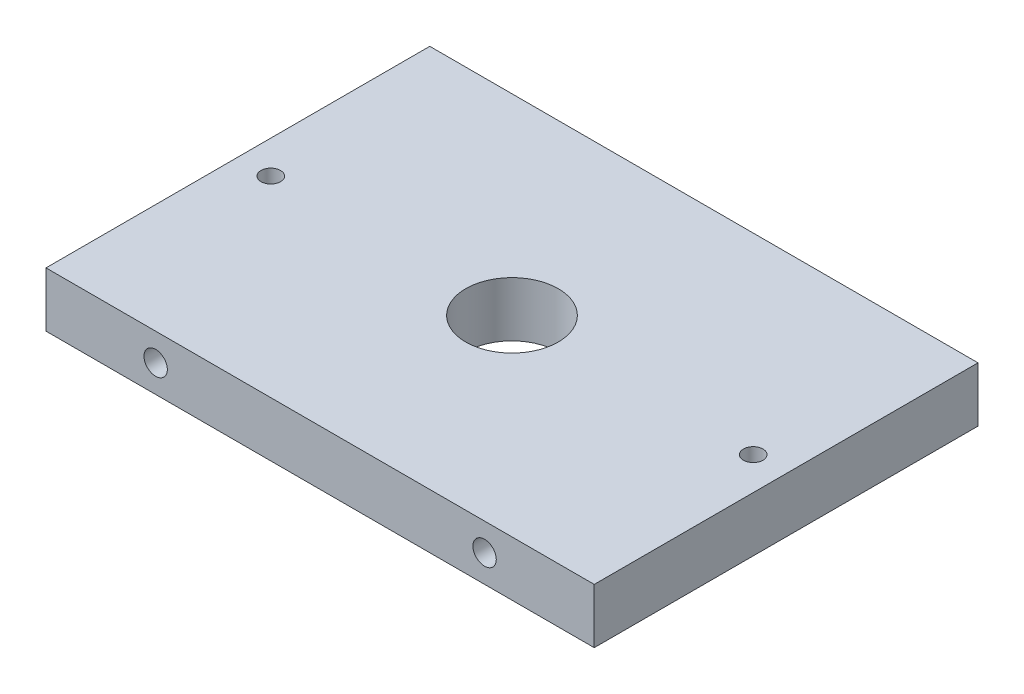
ISO-10303-21;
HEADER;
FILE_DESCRIPTION(('STEP AP214'),'2;1');
FILE_NAME('part.step','',(''),(''),'','','');
FILE_SCHEMA(('AUTOMOTIVE_DESIGN { 1 0 10303 214 1 1 1 1 }'));
ENDSEC;
DATA;
#1=APPLICATION_CONTEXT('core data for automotive mechanical design processes');
#2=APPLICATION_PROTOCOL_DEFINITION('international standard','automotive_design',2000,#1);
#3=PRODUCT_CONTEXT('',#1,'mechanical');
#4=PRODUCT('Part','Part','',(#3));
#5=PRODUCT_RELATED_PRODUCT_CATEGORY('part','',(#4));
#6=PRODUCT_DEFINITION_FORMATION('','',#4);
#7=PRODUCT_DEFINITION_CONTEXT('part definition',#1,'design');
#8=PRODUCT_DEFINITION('design','',#6,#7);
#9=PRODUCT_DEFINITION_SHAPE('','',#8);
#10=(LENGTH_UNIT() NAMED_UNIT(*) SI_UNIT(.MILLI.,.METRE.));
#11=(NAMED_UNIT(*) PLANE_ANGLE_UNIT() SI_UNIT($,.RADIAN.));
#12=(NAMED_UNIT(*) SI_UNIT($,.STERADIAN.) SOLID_ANGLE_UNIT());
#13=UNCERTAINTY_MEASURE_WITH_UNIT(LENGTH_MEASURE(1.E-05),#10,'distance_accuracy_value','');
#14=(GEOMETRIC_REPRESENTATION_CONTEXT(3) GLOBAL_UNCERTAINTY_ASSIGNED_CONTEXT((#13)) GLOBAL_UNIT_ASSIGNED_CONTEXT((#10,
#11,#12)) REPRESENTATION_CONTEXT('',''));
#15=CARTESIAN_POINT('',(0.,0.,0.));
#16=DIRECTION('',(0.,0.,1.));
#17=DIRECTION('',(1.,0.,0.));
#18=AXIS2_PLACEMENT_3D('',#15,#16,#17);
#19=CARTESIAN_POINT('',(-26.9974057296198,6.35,-3.26084320228637));
#20=DIRECTION('',(1.,0.,0.));
#21=DIRECTION('',(0.,0.,-1.));
#22=AXIS2_PLACEMENT_3D('',#19,#20,#21);
#23=PLANE('',#22);
#24=DIRECTION('',(0.,0.,1.));
#25=VECTOR('',#24,1.);
#26=CARTESIAN_POINT('',(-26.9974057296198,0.,-3.26084320228637));
#27=LINE('',#26,#25);
#28=CARTESIAN_POINT('',(-26.9974057296198,0.,-3.26084320228637));
#29=VERTEX_POINT('',#28);
#30=CARTESIAN_POINT('',(-26.9974057296198,0.,41.1891567977136));
#31=VERTEX_POINT('',#30);
#32=EDGE_CURVE('E138',#29,#31,#27,.T.);
#33=ORIENTED_EDGE('',*,*,#32,.T.);
#34=DIRECTION('',(0.,-1.,0.));
#35=VECTOR('',#34,1.);
#36=CARTESIAN_POINT('',(-26.9974057296198,6.35,41.1891567977136));
#37=LINE('',#36,#35);
#38=CARTESIAN_POINT('',(-26.9974057296198,6.35,41.1891567977136));
#39=VERTEX_POINT('',#38);
#40=EDGE_CURVE('E11',#39,#31,#37,.T.);
#41=ORIENTED_EDGE('',*,*,#40,.F.);
#42=DIRECTION('',(0.,0.,1.));
#43=VECTOR('',#42,1.);
#44=CARTESIAN_POINT('',(-26.9974057296198,6.35,-3.26084320228637));
#45=LINE('',#44,#43);
#46=CARTESIAN_POINT('',(-26.9974057296198,6.35,-3.26084320228637));
#47=VERTEX_POINT('',#46);
#48=EDGE_CURVE('E139',#47,#39,#45,.T.);
#49=ORIENTED_EDGE('',*,*,#48,.F.);
#50=DIRECTION('',(0.,-1.,0.));
#51=VECTOR('',#50,1.);
#52=CARTESIAN_POINT('',(-26.9974057296198,6.35,-3.26084320228637));
#53=LINE('',#52,#51);
#54=EDGE_CURVE('E145',#47,#29,#53,.T.);
#55=ORIENTED_EDGE('',*,*,#54,.T.);
#56=EDGE_LOOP('',(#33,#41,#49,#55));
#57=FACE_BOUND('',#56,.T.);
#58=ADVANCED_FACE('F31',(#57),#23,.F.);
#59=CARTESIAN_POINT('',(-26.9974057296198,6.35,41.1891567977136));
#60=DIRECTION('',(0.,0.,-1.));
#61=DIRECTION('',(-1.,0.,0.));
#62=AXIS2_PLACEMENT_3D('',#59,#60,#61);
#63=PLANE('',#62);
#64=CARTESIAN_POINT('',(23.8025942703802,3.175,41.1891567977136));
#65=DIRECTION('',(0.,0.,1.));
#66=DIRECTION('',(1.,0.,0.));
#67=AXIS2_PLACEMENT_3D('',#64,#65,#66);
#68=CIRCLE('',#67,1.35255);
#69=CARTESIAN_POINT('',(25.1551442703802,3.175,41.1891567977136));
#70=VERTEX_POINT('',#69);
#71=EDGE_CURVE('E114',#70,#70,#68,.T.);
#72=ORIENTED_EDGE('',*,*,#71,.F.);
#73=EDGE_LOOP('',(#72));
#74=FACE_BOUND('',#73,.T.);
#75=CARTESIAN_POINT('',(-14.2974057296198,3.175,41.1891567977136));
#76=DIRECTION('',(0.,0.,1.));
#77=DIRECTION('',(1.,0.,0.));
#78=AXIS2_PLACEMENT_3D('',#75,#76,#77);
#79=CIRCLE('',#78,1.35255);
#80=CARTESIAN_POINT('',(-12.9448557296198,3.175,41.1891567977136));
#81=VERTEX_POINT('',#80);
#82=EDGE_CURVE('E120',#81,#81,#79,.T.);
#83=ORIENTED_EDGE('',*,*,#82,.F.);
#84=EDGE_LOOP('',(#83));
#85=FACE_BOUND('',#84,.T.);
#86=DIRECTION('',(1.,0.,0.));
#87=VECTOR('',#86,1.);
#88=CARTESIAN_POINT('',(-26.9974057296198,0.,41.1891567977136));
#89=LINE('',#88,#87);
#90=CARTESIAN_POINT('',(36.5025942703802,0.,41.1891567977136));
#91=VERTEX_POINT('',#90);
#92=EDGE_CURVE('E148',#31,#91,#89,.T.);
#93=ORIENTED_EDGE('',*,*,#92,.T.);
#94=DIRECTION('',(0.,-1.,0.));
#95=VECTOR('',#94,1.);
#96=CARTESIAN_POINT('',(36.5025942703802,6.35,41.1891567977136));
#97=LINE('',#96,#95);
#98=CARTESIAN_POINT('',(36.5025942703802,6.35,41.1891567977136));
#99=VERTEX_POINT('',#98);
#100=EDGE_CURVE('E39',#99,#91,#97,.T.);
#101=ORIENTED_EDGE('',*,*,#100,.F.);
#102=DIRECTION('',(1.,0.,0.));
#103=VECTOR('',#102,1.);
#104=CARTESIAN_POINT('',(-26.9974057296198,6.35,41.1891567977136));
#105=LINE('',#104,#103);
#106=EDGE_CURVE('E78',#39,#99,#105,.T.);
#107=ORIENTED_EDGE('',*,*,#106,.F.);
#108=ORIENTED_EDGE('',*,*,#40,.T.);
#109=EDGE_LOOP('',(#93,#101,#107,#108));
#110=FACE_BOUND('',#109,.T.);
#111=ADVANCED_FACE('F173',(#74,#85,#110),#63,.F.);
#112=CARTESIAN_POINT('',(36.5025942703802,6.35,-3.26084320228637));
#113=DIRECTION('',(-1.,0.,0.));
#114=DIRECTION('',(0.,0.,1.));
#115=AXIS2_PLACEMENT_3D('',#112,#113,#114);
#116=PLANE('',#115);
#117=DIRECTION('',(0.,0.,-1.));
#118=VECTOR('',#117,1.);
#119=CARTESIAN_POINT('',(36.5025942703802,0.,-3.26084320228637));
#120=LINE('',#119,#118);
#121=CARTESIAN_POINT('',(36.5025942703802,0.,-3.26084320228637));
#122=VERTEX_POINT('',#121);
#123=EDGE_CURVE('E65',#91,#122,#120,.T.);
#124=ORIENTED_EDGE('',*,*,#123,.T.);
#125=DIRECTION('',(0.,-1.,0.));
#126=VECTOR('',#125,1.);
#127=CARTESIAN_POINT('',(36.5025942703802,6.35,-3.26084320228637));
#128=LINE('',#127,#126);
#129=CARTESIAN_POINT('',(36.5025942703802,6.35,-3.26084320228637));
#130=VERTEX_POINT('',#129);
#131=EDGE_CURVE('E153',#130,#122,#128,.T.);
#132=ORIENTED_EDGE('',*,*,#131,.F.);
#133=DIRECTION('',(0.,0.,-1.));
#134=VECTOR('',#133,1.);
#135=CARTESIAN_POINT('',(36.5025942703802,6.35,-3.26084320228637));
#136=LINE('',#135,#134);
#137=EDGE_CURVE('E142',#99,#130,#136,.T.);
#138=ORIENTED_EDGE('',*,*,#137,.F.);
#139=ORIENTED_EDGE('',*,*,#100,.T.);
#140=EDGE_LOOP('',(#124,#132,#138,#139));
#141=FACE_BOUND('',#140,.T.);
#142=ADVANCED_FACE('F155',(#141),#116,.F.);
#143=CARTESIAN_POINT('',(-26.9974057296198,6.35,-3.26084320228637));
#144=DIRECTION('',(0.,0.,1.));
#145=DIRECTION('',(1.,0.,0.));
#146=AXIS2_PLACEMENT_3D('',#143,#144,#145);
#147=PLANE('',#146);
#148=CARTESIAN_POINT('',(-14.2974057296198,3.175,-3.26084320228637));
#149=DIRECTION('',(0.,0.,-1.));
#150=DIRECTION('',(-1.,0.,0.));
#151=AXIS2_PLACEMENT_3D('',#148,#149,#150);
#152=CIRCLE('',#151,1.35255);
#153=CARTESIAN_POINT('',(-15.6499557296198,3.175,-3.26084320228637));
#154=VERTEX_POINT('',#153);
#155=EDGE_CURVE('E102',#154,#154,#152,.T.);
#156=ORIENTED_EDGE('',*,*,#155,.F.);
#157=EDGE_LOOP('',(#156));
#158=FACE_BOUND('',#157,.T.);
#159=CARTESIAN_POINT('',(23.8025942703802,3.175,-3.26084320228637));
#160=DIRECTION('',(0.,0.,-1.));
#161=DIRECTION('',(-1.,0.,0.));
#162=AXIS2_PLACEMENT_3D('',#159,#160,#161);
#163=CIRCLE('',#162,1.35255);
#164=CARTESIAN_POINT('',(22.4500442703802,3.175,-3.26084320228637));
#165=VERTEX_POINT('',#164);
#166=EDGE_CURVE('E101',#165,#165,#163,.T.);
#167=ORIENTED_EDGE('',*,*,#166,.F.);
#168=EDGE_LOOP('',(#167));
#169=FACE_BOUND('',#168,.T.);
#170=DIRECTION('',(-1.,0.,0.));
#171=VECTOR('',#170,1.);
#172=CARTESIAN_POINT('',(-26.9974057296198,0.,-3.26084320228637));
#173=LINE('',#172,#171);
#174=EDGE_CURVE('E71',#122,#29,#173,.T.);
#175=ORIENTED_EDGE('',*,*,#174,.T.);
#176=ORIENTED_EDGE('',*,*,#54,.F.);
#177=DIRECTION('',(-1.,0.,0.));
#178=VECTOR('',#177,1.);
#179=CARTESIAN_POINT('',(-26.9974057296198,6.35,-3.26084320228637));
#180=LINE('',#179,#178);
#181=EDGE_CURVE('E47',#130,#47,#180,.T.);
#182=ORIENTED_EDGE('',*,*,#181,.F.);
#183=ORIENTED_EDGE('',*,*,#131,.T.);
#184=EDGE_LOOP('',(#175,#176,#182,#183));
#185=FACE_BOUND('',#184,.T.);
#186=ADVANCED_FACE('F162',(#158,#169,#185),#147,.F.);
#187=CARTESIAN_POINT('',(-26.9974057296198,6.35,41.1891567977136));
#188=DIRECTION('',(0.,1.,0.));
#189=DIRECTION('',(0.,0.,1.));
#190=AXIS2_PLACEMENT_3D('',#187,#188,#189);
#191=PLANE('',#190);
#192=CARTESIAN_POINT('',(4.75259427038018,6.35,18.9641567977136));
#193=DIRECTION('',(0.,1.,0.));
#194=DIRECTION('',(0.,0.,1.));
#195=AXIS2_PLACEMENT_3D('',#192,#193,#194);
#196=CIRCLE('',#195,5.35813);
#197=CARTESIAN_POINT('',(4.75259427038018,6.35,24.3222867977136));
#198=VERTEX_POINT('',#197);
#199=EDGE_CURVE('E227',#198,#198,#196,.T.);
#200=ORIENTED_EDGE('',*,*,#199,.F.);
#201=EDGE_LOOP('',(#200));
#202=FACE_BOUND('',#201,.T.);
#203=CARTESIAN_POINT('',(32.6925942703802,6.35,18.9641567977136));
#204=DIRECTION('',(0.,1.,0.));
#205=DIRECTION('',(0.,0.,1.));
#206=AXIS2_PLACEMENT_3D('',#203,#204,#205);
#207=CIRCLE('',#206,1.1303);
#208=CARTESIAN_POINT('',(32.6925942703802,6.35,20.0944567977136));
#209=VERTEX_POINT('',#208);
#210=EDGE_CURVE('E126',#209,#209,#207,.T.);
#211=ORIENTED_EDGE('',*,*,#210,.F.);
#212=EDGE_LOOP('',(#211));
#213=FACE_BOUND('',#212,.T.);
#214=CARTESIAN_POINT('',(-23.1874057296198,6.35,18.9641567977136));
#215=DIRECTION('',(0.,1.,0.));
#216=DIRECTION('',(0.,0.,1.));
#217=AXIS2_PLACEMENT_3D('',#214,#215,#216);
#218=CIRCLE('',#217,1.1303);
#219=CARTESIAN_POINT('',(-23.1874057296198,6.35,20.0944567977136));
#220=VERTEX_POINT('',#219);
#221=EDGE_CURVE('E135',#220,#220,#218,.T.);
#222=ORIENTED_EDGE('',*,*,#221,.F.);
#223=EDGE_LOOP('',(#222));
#224=FACE_BOUND('',#223,.T.);
#225=ORIENTED_EDGE('',*,*,#48,.T.);
#226=ORIENTED_EDGE('',*,*,#106,.T.);
#227=ORIENTED_EDGE('',*,*,#137,.T.);
#228=ORIENTED_EDGE('',*,*,#181,.T.);
#229=EDGE_LOOP('',(#225,#226,#227,#228));
#230=FACE_BOUND('',#229,.T.);
#231=ADVANCED_FACE('F164',(#202,#213,#224,#230),#191,.T.);
#232=CARTESIAN_POINT('',(-26.9974057296198,0.,41.1891567977136));
#233=DIRECTION('',(0.,1.,0.));
#234=DIRECTION('',(0.,0.,1.));
#235=AXIS2_PLACEMENT_3D('',#232,#233,#234);
#236=PLANE('',#235);
#237=CARTESIAN_POINT('',(4.75259427038018,0.,18.9641567977136));
#238=DIRECTION('',(0.,1.,0.));
#239=DIRECTION('',(0.,0.,1.));
#240=AXIS2_PLACEMENT_3D('',#237,#238,#239);
#241=CIRCLE('',#240,5.35813);
#242=CARTESIAN_POINT('',(4.75259427038018,0.,24.3222867977136));
#243=VERTEX_POINT('',#242);
#244=EDGE_CURVE('E108',#243,#243,#241,.T.);
#245=ORIENTED_EDGE('',*,*,#244,.T.);
#246=EDGE_LOOP('',(#245));
#247=FACE_BOUND('',#246,.T.);
#248=CARTESIAN_POINT('',(32.6925942703802,0.,18.9641567977136));
#249=DIRECTION('',(0.,-1.,0.));
#250=DIRECTION('',(0.,0.,-1.));
#251=AXIS2_PLACEMENT_3D('',#248,#249,#250);
#252=CIRCLE('',#251,1.1303);
#253=CARTESIAN_POINT('',(32.6925942703802,0.,17.8338567977136));
#254=VERTEX_POINT('',#253);
#255=EDGE_CURVE('E129',#254,#254,#252,.T.);
#256=ORIENTED_EDGE('',*,*,#255,.F.);
#257=EDGE_LOOP('',(#256));
#258=FACE_BOUND('',#257,.T.);
#259=CARTESIAN_POINT('',(-23.1874057296198,0.,18.9641567977136));
#260=DIRECTION('',(0.,-1.,0.));
#261=DIRECTION('',(0.,0.,-1.));
#262=AXIS2_PLACEMENT_3D('',#259,#260,#261);
#263=CIRCLE('',#262,1.1303);
#264=CARTESIAN_POINT('',(-23.1874057296198,0.,17.8338567977136));
#265=VERTEX_POINT('',#264);
#266=EDGE_CURVE('E132',#265,#265,#263,.T.);
#267=ORIENTED_EDGE('',*,*,#266,.F.);
#268=EDGE_LOOP('',(#267));
#269=FACE_BOUND('',#268,.T.);
#270=ORIENTED_EDGE('',*,*,#32,.F.);
#271=ORIENTED_EDGE('',*,*,#174,.F.);
#272=ORIENTED_EDGE('',*,*,#123,.F.);
#273=ORIENTED_EDGE('',*,*,#92,.F.);
#274=EDGE_LOOP('',(#270,#271,#272,#273));
#275=FACE_BOUND('',#274,.T.);
#276=ADVANCED_FACE('F158',(#247,#258,#269,#275),#236,.F.);
#277=CARTESIAN_POINT('',(-23.1874057296198,0.,18.9641567977136));
#278=DIRECTION('',(0.,-1.,0.));
#279=DIRECTION('',(0.,0.,-1.));
#280=AXIS2_PLACEMENT_3D('',#277,#278,#279);
#281=CYLINDRICAL_SURFACE('',#280,1.1303);
#282=ORIENTED_EDGE('',*,*,#221,.T.);
#283=EDGE_LOOP('',(#282));
#284=FACE_BOUND('',#283,.T.);
#285=ORIENTED_EDGE('',*,*,#266,.T.);
#286=EDGE_LOOP('',(#285));
#287=FACE_BOUND('',#286,.T.);
#288=ADVANCED_FACE('F210',(#284,#287),#281,.F.);
#289=CARTESIAN_POINT('',(32.6925942703802,0.,18.9641567977136));
#290=DIRECTION('',(0.,-1.,0.));
#291=DIRECTION('',(0.,0.,-1.));
#292=AXIS2_PLACEMENT_3D('',#289,#290,#291);
#293=CYLINDRICAL_SURFACE('',#292,1.1303);
#294=ORIENTED_EDGE('',*,*,#210,.T.);
#295=EDGE_LOOP('',(#294));
#296=FACE_BOUND('',#295,.T.);
#297=ORIENTED_EDGE('',*,*,#255,.T.);
#298=EDGE_LOOP('',(#297));
#299=FACE_BOUND('',#298,.T.);
#300=ADVANCED_FACE('F202',(#296,#299),#293,.F.);
#301=CARTESIAN_POINT('',(-14.2974057296198,3.175,34.8391567977136));
#302=DIRECTION('',(0.,0.,1.));
#303=DIRECTION('',(1.,0.,0.));
#304=AXIS2_PLACEMENT_3D('',#301,#302,#303);
#305=CONICAL_SURFACE('',#304,1.35255,1.02974425867665);
#306=CARTESIAN_POINT('',(-14.2974057296198,3.175,34.0264627674479));
#307=VERTEX_POINT('',#306);
#308=VERTEX_LOOP('',#307);
#309=FACE_BOUND('',#308,.T.);
#310=CARTESIAN_POINT('',(-14.2974057296198,3.175,34.8391567977136));
#311=DIRECTION('',(0.,0.,1.));
#312=DIRECTION('',(1.,0.,0.));
#313=AXIS2_PLACEMENT_3D('',#310,#311,#312);
#314=CIRCLE('',#313,1.35255);
#315=CARTESIAN_POINT('',(-12.9448557296198,3.175,34.8391567977136));
#316=VERTEX_POINT('',#315);
#317=EDGE_CURVE('E123',#316,#316,#314,.T.);
#318=ORIENTED_EDGE('',*,*,#317,.T.);
#319=EDGE_LOOP('',(#318));
#320=FACE_BOUND('',#319,.T.);
#321=ADVANCED_FACE('F192',(#309,#320),#305,.F.);
#322=CARTESIAN_POINT('',(-14.2974057296198,3.175,41.1891567977136));
#323=DIRECTION('',(0.,0.,1.));
#324=DIRECTION('',(1.,0.,0.));
#325=AXIS2_PLACEMENT_3D('',#322,#323,#324);
#326=CYLINDRICAL_SURFACE('',#325,1.35255);
#327=ORIENTED_EDGE('',*,*,#317,.F.);
#328=EDGE_LOOP('',(#327));
#329=FACE_BOUND('',#328,.T.);
#330=ORIENTED_EDGE('',*,*,#82,.T.);
#331=EDGE_LOOP('',(#330));
#332=FACE_BOUND('',#331,.T.);
#333=ADVANCED_FACE('F189',(#329,#332),#326,.F.);
#334=CARTESIAN_POINT('',(23.8025942703802,3.175,34.8391567977136));
#335=DIRECTION('',(0.,0.,1.));
#336=DIRECTION('',(1.,0.,0.));
#337=AXIS2_PLACEMENT_3D('',#334,#335,#336);
#338=CONICAL_SURFACE('',#337,1.35255,1.02974425867665);
#339=CARTESIAN_POINT('',(23.8025942703802,3.175,34.0264627674479));
#340=VERTEX_POINT('',#339);
#341=VERTEX_LOOP('',#340);
#342=FACE_BOUND('',#341,.T.);
#343=CARTESIAN_POINT('',(23.8025942703802,3.175,34.8391567977136));
#344=DIRECTION('',(0.,0.,1.));
#345=DIRECTION('',(1.,0.,0.));
#346=AXIS2_PLACEMENT_3D('',#343,#344,#345);
#347=CIRCLE('',#346,1.35255);
#348=CARTESIAN_POINT('',(25.1551442703802,3.175,34.8391567977136));
#349=VERTEX_POINT('',#348);
#350=EDGE_CURVE('E117',#349,#349,#347,.T.);
#351=ORIENTED_EDGE('',*,*,#350,.T.);
#352=EDGE_LOOP('',(#351));
#353=FACE_BOUND('',#352,.T.);
#354=ADVANCED_FACE('F191',(#342,#353),#338,.F.);
#355=CARTESIAN_POINT('',(23.8025942703802,3.175,41.1891567977136));
#356=DIRECTION('',(0.,0.,1.));
#357=DIRECTION('',(1.,0.,0.));
#358=AXIS2_PLACEMENT_3D('',#355,#356,#357);
#359=CYLINDRICAL_SURFACE('',#358,1.35255);
#360=ORIENTED_EDGE('',*,*,#350,.F.);
#361=EDGE_LOOP('',(#360));
#362=FACE_BOUND('',#361,.T.);
#363=ORIENTED_EDGE('',*,*,#71,.T.);
#364=EDGE_LOOP('',(#363));
#365=FACE_BOUND('',#364,.T.);
#366=ADVANCED_FACE('F199',(#362,#365),#359,.F.);
#367=CARTESIAN_POINT('',(23.8025942703802,3.175,3.08915679771363));
#368=DIRECTION('',(0.,0.,-1.));
#369=DIRECTION('',(-1.,0.,0.));
#370=AXIS2_PLACEMENT_3D('',#367,#368,#369);
#371=CONICAL_SURFACE('',#370,1.35255,1.02974425867665);
#372=CARTESIAN_POINT('',(23.8025942703802,3.175,3.90185082797935));
#373=VERTEX_POINT('',#372);
#374=VERTEX_LOOP('',#373);
#375=FACE_BOUND('',#374,.T.);
#376=CARTESIAN_POINT('',(23.8025942703802,3.175,3.08915679771363));
#377=DIRECTION('',(0.,0.,-1.));
#378=DIRECTION('',(-1.,0.,0.));
#379=AXIS2_PLACEMENT_3D('',#376,#377,#378);
#380=CIRCLE('',#379,1.35255);
#381=CARTESIAN_POINT('',(22.4500442703802,3.175,3.08915679771363));
#382=VERTEX_POINT('',#381);
#383=EDGE_CURVE('E105',#382,#382,#380,.T.);
#384=ORIENTED_EDGE('',*,*,#383,.T.);
#385=EDGE_LOOP('',(#384));
#386=FACE_BOUND('',#385,.T.);
#387=ADVANCED_FACE('F246',(#375,#386),#371,.F.);
#388=CARTESIAN_POINT('',(23.8025942703802,3.175,-3.26084320228637));
#389=DIRECTION('',(0.,0.,-1.));
#390=DIRECTION('',(-1.,0.,0.));
#391=AXIS2_PLACEMENT_3D('',#388,#389,#390);
#392=CYLINDRICAL_SURFACE('',#391,1.35255);
#393=ORIENTED_EDGE('',*,*,#383,.F.);
#394=EDGE_LOOP('',(#393));
#395=FACE_BOUND('',#394,.T.);
#396=ORIENTED_EDGE('',*,*,#166,.T.);
#397=EDGE_LOOP('',(#396));
#398=FACE_BOUND('',#397,.T.);
#399=ADVANCED_FACE('F95',(#395,#398),#392,.F.);
#400=CARTESIAN_POINT('',(-14.2974057296198,3.175,3.08915679771363));
#401=DIRECTION('',(0.,0.,-1.));
#402=DIRECTION('',(-1.,0.,0.));
#403=AXIS2_PLACEMENT_3D('',#400,#401,#402);
#404=CONICAL_SURFACE('',#403,1.35255,1.02974425867665);
#405=CARTESIAN_POINT('',(-14.2974057296198,3.175,3.90185082797935));
#406=VERTEX_POINT('',#405);
#407=VERTEX_LOOP('',#406);
#408=FACE_BOUND('',#407,.T.);
#409=CARTESIAN_POINT('',(-14.2974057296198,3.175,3.08915679771363));
#410=DIRECTION('',(0.,0.,-1.));
#411=DIRECTION('',(-1.,0.,0.));
#412=AXIS2_PLACEMENT_3D('',#409,#410,#411);
#413=CIRCLE('',#412,1.35255);
#414=CARTESIAN_POINT('',(-15.6499557296198,3.175,3.08915679771363));
#415=VERTEX_POINT('',#414);
#416=EDGE_CURVE('E99',#415,#415,#413,.T.);
#417=ORIENTED_EDGE('',*,*,#416,.T.);
#418=EDGE_LOOP('',(#417));
#419=FACE_BOUND('',#418,.T.);
#420=ADVANCED_FACE('F91',(#408,#419),#404,.F.);
#421=CARTESIAN_POINT('',(-14.2974057296198,3.175,-3.26084320228637));
#422=DIRECTION('',(0.,0.,-1.));
#423=DIRECTION('',(-1.,0.,0.));
#424=AXIS2_PLACEMENT_3D('',#421,#422,#423);
#425=CYLINDRICAL_SURFACE('',#424,1.35255);
#426=ORIENTED_EDGE('',*,*,#416,.F.);
#427=EDGE_LOOP('',(#426));
#428=FACE_BOUND('',#427,.T.);
#429=ORIENTED_EDGE('',*,*,#155,.T.);
#430=EDGE_LOOP('',(#429));
#431=FACE_BOUND('',#430,.T.);
#432=ADVANCED_FACE('F94',(#428,#431),#425,.F.);
#433=CARTESIAN_POINT('',(4.75259427038018,6.35,18.9641567977136));
#434=DIRECTION('',(0.,1.,0.));
#435=DIRECTION('',(0.,0.,1.));
#436=AXIS2_PLACEMENT_3D('',#433,#434,#435);
#437=CYLINDRICAL_SURFACE('',#436,5.35813);
#438=ORIENTED_EDGE('',*,*,#244,.F.);
#439=EDGE_LOOP('',(#438));
#440=FACE_BOUND('',#439,.T.);
#441=ORIENTED_EDGE('',*,*,#199,.T.);
#442=EDGE_LOOP('',(#441));
#443=FACE_BOUND('',#442,.T.);
#444=ADVANCED_FACE('F232',(#440,#443),#437,.F.);
#445=CLOSED_SHELL('',(#58,#111,#142,#186,#231,#276,#288,#300,#321,#333,#354,#366,#387,#399,#420,
#432,#444));
#446=MANIFOLD_SOLID_BREP('B2',#445);
#447=ADVANCED_BREP_SHAPE_REPRESENTATION('',(#18,#446),#14);
#448=SHAPE_DEFINITION_REPRESENTATION(#9,#447);
ENDSEC;
END-ISO-10303-21;
